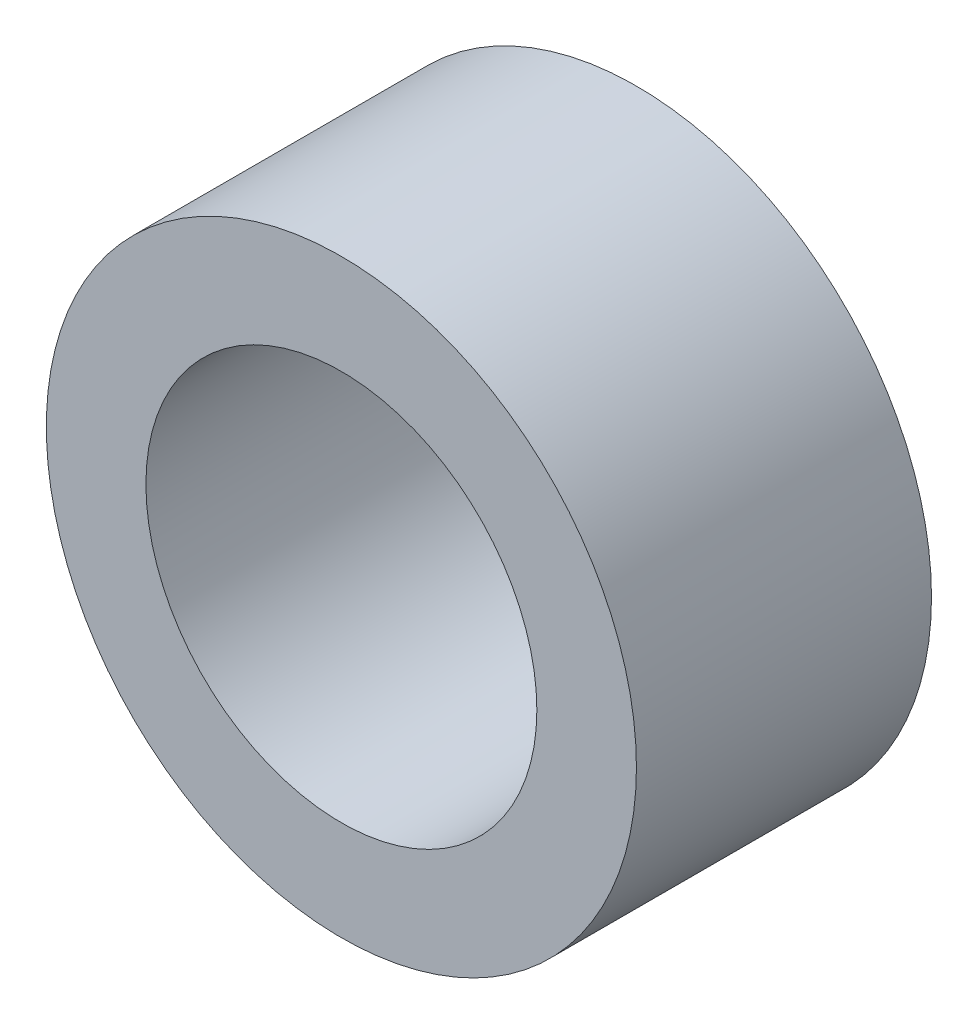
ISO-10303-21;
HEADER;
FILE_DESCRIPTION(('STEP AP214'),'2;1');
FILE_NAME('part.step','',(''),(''),'','','');
FILE_SCHEMA(('AUTOMOTIVE_DESIGN { 1 0 10303 214 1 1 1 1 }'));
ENDSEC;
DATA;
#1=APPLICATION_CONTEXT('core data for automotive mechanical design processes');
#2=APPLICATION_PROTOCOL_DEFINITION('international standard','automotive_design',2000,#1);
#3=PRODUCT_CONTEXT('',#1,'mechanical');
#4=PRODUCT('Part','Part','',(#3));
#5=PRODUCT_RELATED_PRODUCT_CATEGORY('part','',(#4));
#6=PRODUCT_DEFINITION_FORMATION('','',#4);
#7=PRODUCT_DEFINITION_CONTEXT('part definition',#1,'design');
#8=PRODUCT_DEFINITION('design','',#6,#7);
#9=PRODUCT_DEFINITION_SHAPE('','',#8);
#10=(LENGTH_UNIT() NAMED_UNIT(*) SI_UNIT(.MILLI.,.METRE.));
#11=(NAMED_UNIT(*) PLANE_ANGLE_UNIT() SI_UNIT($,.RADIAN.));
#12=(NAMED_UNIT(*) SI_UNIT($,.STERADIAN.) SOLID_ANGLE_UNIT());
#13=UNCERTAINTY_MEASURE_WITH_UNIT(LENGTH_MEASURE(1.E-05),#10,'distance_accuracy_value','');
#14=(GEOMETRIC_REPRESENTATION_CONTEXT(3) GLOBAL_UNCERTAINTY_ASSIGNED_CONTEXT((#13)) GLOBAL_UNIT_ASSIGNED_CONTEXT((#10,
#11,#12)) REPRESENTATION_CONTEXT('',''));
#15=CARTESIAN_POINT('',(0.,0.,0.));
#16=DIRECTION('',(0.,0.,1.));
#17=DIRECTION('',(1.,0.,0.));
#18=AXIS2_PLACEMENT_3D('',#15,#16,#17);
#19=CARTESIAN_POINT('',(0.,0.,2.));
#20=DIRECTION('',(0.,0.,1.));
#21=DIRECTION('',(1.,0.,0.));
#22=AXIS2_PLACEMENT_3D('',#19,#20,#21);
#23=PLANE('',#22);
#24=CARTESIAN_POINT('',(0.,0.,2.));
#25=DIRECTION('',(0.,0.,1.));
#26=DIRECTION('',(1.,0.,0.));
#27=AXIS2_PLACEMENT_3D('',#24,#25,#26);
#28=CIRCLE('',#27,4.);
#29=CARTESIAN_POINT('',(4.,0.,2.));
#30=VERTEX_POINT('',#29);
#31=EDGE_CURVE('E10',#30,#30,#28,.T.);
#32=ORIENTED_EDGE('',*,*,#31,.T.);
#33=EDGE_LOOP('',(#32));
#34=FACE_BOUND('',#33,.T.);
#35=CARTESIAN_POINT('',(0.,0.,2.));
#36=DIRECTION('',(0.,0.,1.));
#37=DIRECTION('',(1.,0.,0.));
#38=AXIS2_PLACEMENT_3D('',#35,#36,#37);
#39=CIRCLE('',#38,2.65);
#40=CARTESIAN_POINT('',(2.65,0.,2.));
#41=VERTEX_POINT('',#40);
#42=EDGE_CURVE('E35',#41,#41,#39,.T.);
#43=ORIENTED_EDGE('',*,*,#42,.F.);
#44=EDGE_LOOP('',(#43));
#45=FACE_BOUND('',#44,.T.);
#46=ADVANCED_FACE('F28',(#34,#45),#23,.T.);
#47=CARTESIAN_POINT('',(0.,0.,2.));
#48=DIRECTION('',(0.,0.,-1.));
#49=DIRECTION('',(-1.,0.,0.));
#50=AXIS2_PLACEMENT_3D('',#47,#48,#49);
#51=CYLINDRICAL_SURFACE('',#50,4.);
#52=ORIENTED_EDGE('',*,*,#31,.F.);
#53=EDGE_LOOP('',(#52));
#54=FACE_BOUND('',#53,.T.);
#55=CARTESIAN_POINT('',(0.,0.,-2.));
#56=DIRECTION('',(0.,0.,1.));
#57=DIRECTION('',(1.,0.,0.));
#58=AXIS2_PLACEMENT_3D('',#55,#56,#57);
#59=CIRCLE('',#58,4.);
#60=CARTESIAN_POINT('',(4.,0.,-2.));
#61=VERTEX_POINT('',#60);
#62=EDGE_CURVE('E39',#61,#61,#59,.T.);
#63=ORIENTED_EDGE('',*,*,#62,.T.);
#64=EDGE_LOOP('',(#63));
#65=FACE_BOUND('',#64,.T.);
#66=ADVANCED_FACE('F30',(#54,#65),#51,.T.);
#67=CARTESIAN_POINT('',(0.,0.,2.));
#68=DIRECTION('',(0.,0.,-1.));
#69=DIRECTION('',(-1.,0.,0.));
#70=AXIS2_PLACEMENT_3D('',#67,#68,#69);
#71=CYLINDRICAL_SURFACE('',#70,2.65);
#72=ORIENTED_EDGE('',*,*,#42,.T.);
#73=EDGE_LOOP('',(#72));
#74=FACE_BOUND('',#73,.T.);
#75=CARTESIAN_POINT('',(0.,0.,-2.));
#76=DIRECTION('',(0.,0.,1.));
#77=DIRECTION('',(1.,0.,0.));
#78=AXIS2_PLACEMENT_3D('',#75,#76,#77);
#79=CIRCLE('',#78,2.65);
#80=CARTESIAN_POINT('',(2.65,0.,-2.));
#81=VERTEX_POINT('',#80);
#82=EDGE_CURVE('E43',#81,#81,#79,.T.);
#83=ORIENTED_EDGE('',*,*,#82,.F.);
#84=EDGE_LOOP('',(#83));
#85=FACE_BOUND('',#84,.T.);
#86=ADVANCED_FACE('F52',(#74,#85),#71,.F.);
#87=CARTESIAN_POINT('',(0.,0.,-2.));
#88=DIRECTION('',(0.,0.,1.));
#89=DIRECTION('',(1.,0.,0.));
#90=AXIS2_PLACEMENT_3D('',#87,#88,#89);
#91=PLANE('',#90);
#92=ORIENTED_EDGE('',*,*,#82,.T.);
#93=EDGE_LOOP('',(#92));
#94=FACE_BOUND('',#93,.T.);
#95=ORIENTED_EDGE('',*,*,#62,.F.);
#96=EDGE_LOOP('',(#95));
#97=FACE_BOUND('',#96,.T.);
#98=ADVANCED_FACE('F49',(#94,#97),#91,.F.);
#99=CLOSED_SHELL('',(#46,#66,#86,#98));
#100=MANIFOLD_SOLID_BREP('B2',#99);
#101=ADVANCED_BREP_SHAPE_REPRESENTATION('',(#18,#100),#14);
#102=SHAPE_DEFINITION_REPRESENTATION(#9,#101);
ENDSEC;
END-ISO-10303-21;
